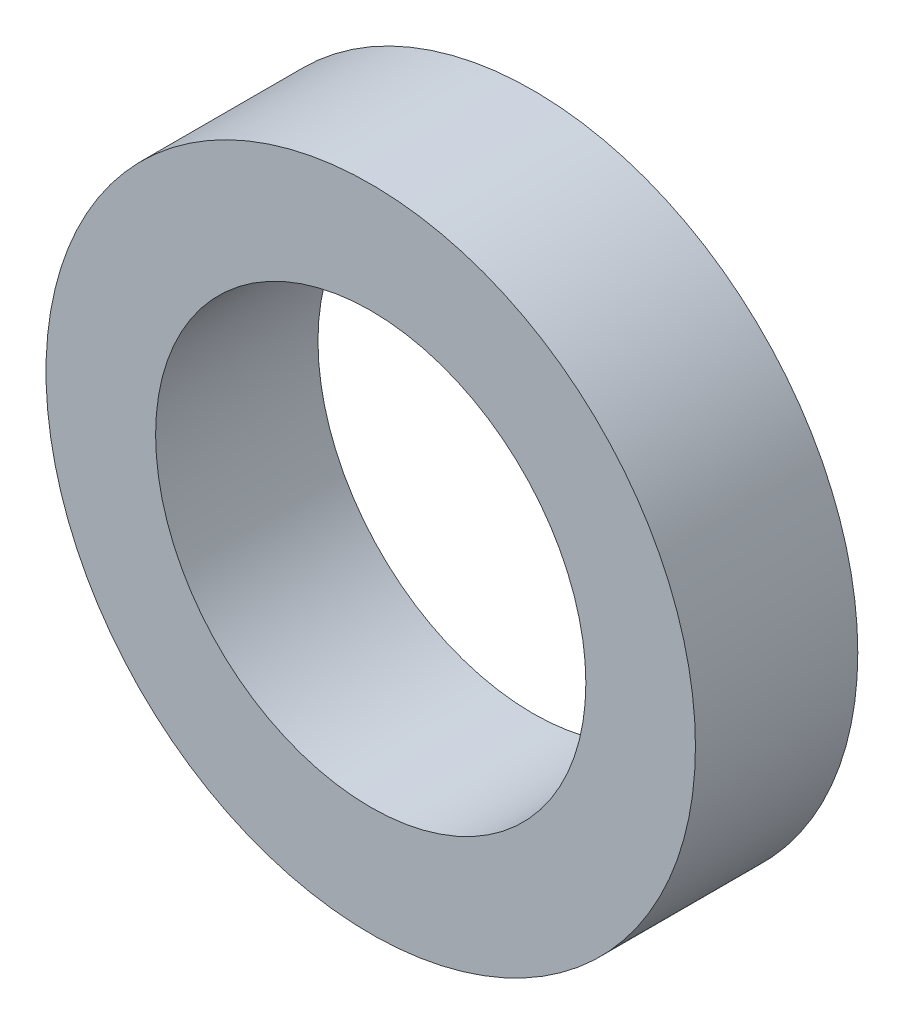
ISO-10303-21;
HEADER;
FILE_DESCRIPTION(('STEP AP214'),'2;1');
FILE_NAME('part.step','',(''),(''),'','','');
FILE_SCHEMA(('AUTOMOTIVE_DESIGN { 1 0 10303 214 1 1 1 1 }'));
ENDSEC;
DATA;
#1=APPLICATION_CONTEXT('core data for automotive mechanical design processes');
#2=APPLICATION_PROTOCOL_DEFINITION('international standard','automotive_design',2000,#1);
#3=PRODUCT_CONTEXT('',#1,'mechanical');
#4=PRODUCT('Part','Part','',(#3));
#5=PRODUCT_RELATED_PRODUCT_CATEGORY('part','',(#4));
#6=PRODUCT_DEFINITION_FORMATION('','',#4);
#7=PRODUCT_DEFINITION_CONTEXT('part definition',#1,'design');
#8=PRODUCT_DEFINITION('design','',#6,#7);
#9=PRODUCT_DEFINITION_SHAPE('','',#8);
#10=(LENGTH_UNIT() NAMED_UNIT(*) SI_UNIT(.MILLI.,.METRE.));
#11=(NAMED_UNIT(*) PLANE_ANGLE_UNIT() SI_UNIT($,.RADIAN.));
#12=(NAMED_UNIT(*) SI_UNIT($,.STERADIAN.) SOLID_ANGLE_UNIT());
#13=UNCERTAINTY_MEASURE_WITH_UNIT(LENGTH_MEASURE(1.E-05),#10,'distance_accuracy_value','');
#14=(GEOMETRIC_REPRESENTATION_CONTEXT(3) GLOBAL_UNCERTAINTY_ASSIGNED_CONTEXT((#13)) GLOBAL_UNIT_ASSIGNED_CONTEXT((#10,
#11,#12)) REPRESENTATION_CONTEXT('',''));
#15=CARTESIAN_POINT('',(0.,0.,0.));
#16=DIRECTION('',(0.,0.,1.));
#17=DIRECTION('',(1.,0.,0.));
#18=AXIS2_PLACEMENT_3D('',#15,#16,#17);
#19=CARTESIAN_POINT('',(0.,0.,1.));
#20=DIRECTION('',(0.,0.,1.));
#21=DIRECTION('',(1.,0.,0.));
#22=AXIS2_PLACEMENT_3D('',#19,#20,#21);
#23=PLANE('',#22);
#24=CARTESIAN_POINT('',(0.,0.,1.));
#25=DIRECTION('',(0.,0.,1.));
#26=DIRECTION('',(1.,0.,0.));
#27=AXIS2_PLACEMENT_3D('',#24,#25,#26);
#28=CIRCLE('',#27,4.);
#29=CARTESIAN_POINT('',(4.,0.,1.));
#30=VERTEX_POINT('',#29);
#31=EDGE_CURVE('E10',#30,#30,#28,.T.);
#32=ORIENTED_EDGE('',*,*,#31,.T.);
#33=EDGE_LOOP('',(#32));
#34=FACE_BOUND('',#33,.T.);
#35=CARTESIAN_POINT('',(0.,0.,1.));
#36=DIRECTION('',(0.,0.,1.));
#37=DIRECTION('',(1.,0.,0.));
#38=AXIS2_PLACEMENT_3D('',#35,#36,#37);
#39=CIRCLE('',#38,2.65);
#40=CARTESIAN_POINT('',(2.65,0.,1.));
#41=VERTEX_POINT('',#40);
#42=EDGE_CURVE('E37',#41,#41,#39,.T.);
#43=ORIENTED_EDGE('',*,*,#42,.F.);
#44=EDGE_LOOP('',(#43));
#45=FACE_BOUND('',#44,.T.);
#46=ADVANCED_FACE('F30',(#34,#45),#23,.T.);
#47=CARTESIAN_POINT('',(0.,0.,1.));
#48=DIRECTION('',(0.,0.,-1.));
#49=DIRECTION('',(-1.,0.,0.));
#50=AXIS2_PLACEMENT_3D('',#47,#48,#49);
#51=CYLINDRICAL_SURFACE('',#50,4.);
#52=ORIENTED_EDGE('',*,*,#31,.F.);
#53=EDGE_LOOP('',(#52));
#54=FACE_BOUND('',#53,.T.);
#55=CARTESIAN_POINT('',(0.,0.,-1.));
#56=DIRECTION('',(0.,0.,1.));
#57=DIRECTION('',(1.,0.,0.));
#58=AXIS2_PLACEMENT_3D('',#55,#56,#57);
#59=CIRCLE('',#58,4.);
#60=CARTESIAN_POINT('',(4.,0.,-1.));
#61=VERTEX_POINT('',#60);
#62=EDGE_CURVE('E41',#61,#61,#59,.T.);
#63=ORIENTED_EDGE('',*,*,#62,.T.);
#64=EDGE_LOOP('',(#63));
#65=FACE_BOUND('',#64,.T.);
#66=ADVANCED_FACE('F32',(#54,#65),#51,.T.);
#67=CARTESIAN_POINT('',(0.,0.,1.));
#68=DIRECTION('',(0.,0.,-1.));
#69=DIRECTION('',(-1.,0.,0.));
#70=AXIS2_PLACEMENT_3D('',#67,#68,#69);
#71=CYLINDRICAL_SURFACE('',#70,2.65);
#72=ORIENTED_EDGE('',*,*,#42,.T.);
#73=EDGE_LOOP('',(#72));
#74=FACE_BOUND('',#73,.T.);
#75=CARTESIAN_POINT('',(0.,0.,-1.));
#76=DIRECTION('',(0.,0.,1.));
#77=DIRECTION('',(1.,0.,0.));
#78=AXIS2_PLACEMENT_3D('',#75,#76,#77);
#79=CIRCLE('',#78,2.65);
#80=CARTESIAN_POINT('',(2.65,0.,-1.));
#81=VERTEX_POINT('',#80);
#82=EDGE_CURVE('E45',#81,#81,#79,.T.);
#83=ORIENTED_EDGE('',*,*,#82,.F.);
#84=EDGE_LOOP('',(#83));
#85=FACE_BOUND('',#84,.T.);
#86=ADVANCED_FACE('F54',(#74,#85),#71,.F.);
#87=CARTESIAN_POINT('',(0.,0.,-1.));
#88=DIRECTION('',(0.,0.,1.));
#89=DIRECTION('',(1.,0.,0.));
#90=AXIS2_PLACEMENT_3D('',#87,#88,#89);
#91=PLANE('',#90);
#92=ORIENTED_EDGE('',*,*,#82,.T.);
#93=EDGE_LOOP('',(#92));
#94=FACE_BOUND('',#93,.T.);
#95=ORIENTED_EDGE('',*,*,#62,.F.);
#96=EDGE_LOOP('',(#95));
#97=FACE_BOUND('',#96,.T.);
#98=ADVANCED_FACE('F51',(#94,#97),#91,.F.);
#99=CLOSED_SHELL('',(#46,#66,#86,#98));
#100=MANIFOLD_SOLID_BREP('B2',#99);
#101=ADVANCED_BREP_SHAPE_REPRESENTATION('',(#18,#100),#14);
#102=SHAPE_DEFINITION_REPRESENTATION(#9,#101);
ENDSEC;
END-ISO-10303-21;
